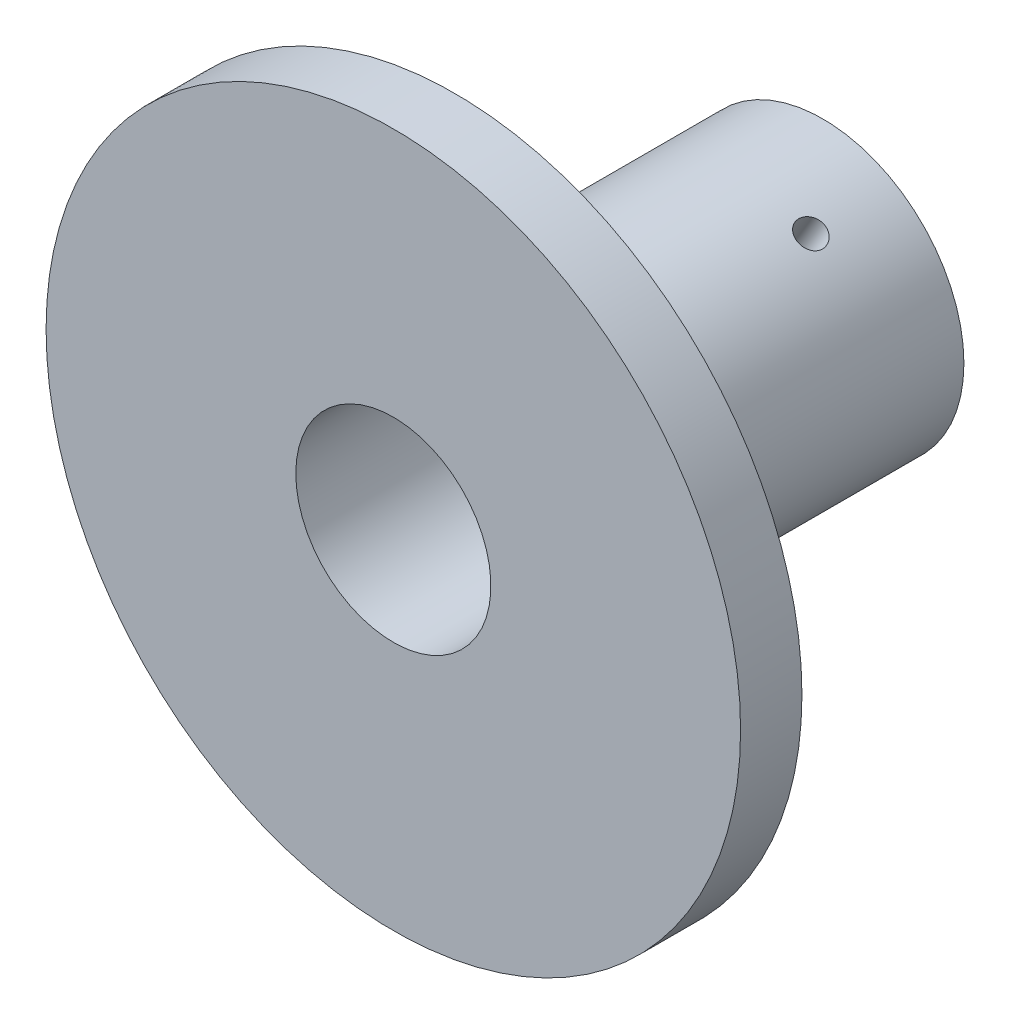
ISO-10303-21;
HEADER;
FILE_DESCRIPTION(('STEP AP214'),'2;1');
FILE_NAME('part.step','',(''),(''),'','','');
FILE_SCHEMA(('AUTOMOTIVE_DESIGN { 1 0 10303 214 1 1 1 1 }'));
ENDSEC;
DATA;
#1=APPLICATION_CONTEXT('core data for automotive mechanical design processes');
#2=APPLICATION_PROTOCOL_DEFINITION('international standard','automotive_design',2000,#1);
#3=PRODUCT_CONTEXT('',#1,'mechanical');
#4=PRODUCT('Part','Part','',(#3));
#5=PRODUCT_RELATED_PRODUCT_CATEGORY('part','',(#4));
#6=PRODUCT_DEFINITION_FORMATION('','',#4);
#7=PRODUCT_DEFINITION_CONTEXT('part definition',#1,'design');
#8=PRODUCT_DEFINITION('design','',#6,#7);
#9=PRODUCT_DEFINITION_SHAPE('','',#8);
#10=(LENGTH_UNIT() NAMED_UNIT(*) SI_UNIT(.MILLI.,.METRE.));
#11=(NAMED_UNIT(*) PLANE_ANGLE_UNIT() SI_UNIT($,.RADIAN.));
#12=(NAMED_UNIT(*) SI_UNIT($,.STERADIAN.) SOLID_ANGLE_UNIT());
#13=UNCERTAINTY_MEASURE_WITH_UNIT(LENGTH_MEASURE(1.E-05),#10,'distance_accuracy_value','');
#14=(GEOMETRIC_REPRESENTATION_CONTEXT(3) GLOBAL_UNCERTAINTY_ASSIGNED_CONTEXT((#13)) GLOBAL_UNIT_ASSIGNED_CONTEXT((#10,
#11,#12)) REPRESENTATION_CONTEXT('',''));
#15=CARTESIAN_POINT('',(0.,0.,0.));
#16=DIRECTION('',(0.,0.,1.));
#17=DIRECTION('',(1.,0.,0.));
#18=AXIS2_PLACEMENT_3D('',#15,#16,#17);
#19=CARTESIAN_POINT('',(0.,0.,0.));
#20=DIRECTION('',(0.,0.,1.));
#21=DIRECTION('',(1.,0.,0.));
#22=AXIS2_PLACEMENT_3D('',#19,#20,#21);
#23=PLANE('',#22);
#24=CARTESIAN_POINT('',(0.,0.,0.));
#25=DIRECTION('',(0.,0.,1.));
#26=DIRECTION('',(1.,0.,0.));
#27=AXIS2_PLACEMENT_3D('',#24,#25,#26);
#28=CIRCLE('',#27,28.3);
#29=CARTESIAN_POINT('',(28.3,0.,0.));
#30=VERTEX_POINT('',#29);
#31=EDGE_CURVE('E42',#30,#30,#28,.T.);
#32=ORIENTED_EDGE('',*,*,#31,.F.);
#33=EDGE_LOOP('',(#32));
#34=FACE_BOUND('',#33,.T.);
#35=CARTESIAN_POINT('',(0.,0.,0.));
#36=DIRECTION('',(0.,0.,1.));
#37=DIRECTION('',(1.,0.,0.));
#38=AXIS2_PLACEMENT_3D('',#35,#36,#37);
#39=CIRCLE('',#38,11.5);
#40=CARTESIAN_POINT('',(11.5,0.,0.));
#41=VERTEX_POINT('',#40);
#42=EDGE_CURVE('E10',#41,#41,#39,.F.);
#43=ORIENTED_EDGE('',*,*,#42,.F.);
#44=EDGE_LOOP('',(#43));
#45=FACE_BOUND('',#44,.T.);
#46=ADVANCED_FACE('F31',(#34,#45),#23,.F.);
#47=CARTESIAN_POINT('',(0.,0.,5.));
#48=DIRECTION('',(0.,0.,-1.));
#49=DIRECTION('',(-1.,0.,0.));
#50=AXIS2_PLACEMENT_3D('',#47,#48,#49);
#51=CYLINDRICAL_SURFACE('',#50,28.3);
#52=CARTESIAN_POINT('',(0.,0.,5.));
#53=DIRECTION('',(0.,0.,1.));
#54=DIRECTION('',(1.,0.,0.));
#55=AXIS2_PLACEMENT_3D('',#52,#53,#54);
#56=CIRCLE('',#55,28.3);
#57=CARTESIAN_POINT('',(28.3,0.,5.));
#58=VERTEX_POINT('',#57);
#59=EDGE_CURVE('E38',#58,#58,#56,.T.);
#60=ORIENTED_EDGE('',*,*,#59,.F.);
#61=EDGE_LOOP('',(#60));
#62=FACE_BOUND('',#61,.T.);
#63=ORIENTED_EDGE('',*,*,#31,.T.);
#64=EDGE_LOOP('',(#63));
#65=FACE_BOUND('',#64,.T.);
#66=ADVANCED_FACE('F33',(#62,#65),#51,.T.);
#67=CARTESIAN_POINT('',(0.,0.,5.));
#68=DIRECTION('',(0.,0.,1.));
#69=DIRECTION('',(1.,0.,0.));
#70=AXIS2_PLACEMENT_3D('',#67,#68,#69);
#71=PLANE('',#70);
#72=CARTESIAN_POINT('',(0.,0.,5.));
#73=DIRECTION('',(0.,0.,-1.));
#74=DIRECTION('',(-1.,0.,0.));
#75=AXIS2_PLACEMENT_3D('',#72,#73,#74);
#76=CIRCLE('',#75,7.95);
#77=CARTESIAN_POINT('',(-7.95,0.,5.));
#78=VERTEX_POINT('',#77);
#79=EDGE_CURVE('E51',#78,#78,#76,.T.);
#80=ORIENTED_EDGE('',*,*,#79,.T.);
#81=EDGE_LOOP('',(#80));
#82=FACE_BOUND('',#81,.T.);
#83=ORIENTED_EDGE('',*,*,#59,.T.);
#84=EDGE_LOOP('',(#83));
#85=FACE_BOUND('',#84,.T.);
#86=ADVANCED_FACE('F93',(#82,#85),#71,.T.);
#87=CARTESIAN_POINT('',(0.,0.,-30.));
#88=DIRECTION('',(0.,0.,1.));
#89=DIRECTION('',(1.,0.,0.));
#90=AXIS2_PLACEMENT_3D('',#87,#88,#89);
#91=CYLINDRICAL_SURFACE('',#90,11.5);
#92=CARTESIAN_POINT('',(4.95143261181863,10.3794660310933,-23.0908595693222));
#93=CARTESIAN_POINT('',(4.95143533973217,10.3794652363557,-23.1541842830061));
#94=CARTESIAN_POINT('',(4.95627734287464,10.377159188206,-23.217551004948));
#95=CARTESIAN_POINT('',(4.97549741899569,10.3679571071766,-23.342527982358));
#96=CARTESIAN_POINT('',(4.98988603402111,10.3610560000765,-23.4041362174475));
#97=CARTESIAN_POINT('',(5.02770916813772,10.3427549140707,-23.5237682432997));
#98=CARTESIAN_POINT('',(5.05113824269521,10.3313576428462,-23.5817941671249));
#99=CARTESIAN_POINT('',(5.1062640418036,10.3042227665628,-23.6926546462028));
#100=CARTESIAN_POINT('',(5.13795911038223,10.2884860308166,-23.745490238348));
#101=CARTESIAN_POINT('',(5.20870983172219,10.252848925534,-23.8446687849303));
#102=CARTESIAN_POINT('',(5.24778819150571,10.232935689967,-23.8909909198806));
#103=CARTESIAN_POINT('',(5.33200701723056,10.1893054540452,-23.9756484049697));
#104=CARTESIAN_POINT('',(5.37714775897332,10.1655882806247,-24.0139833915393));
#105=CARTESIAN_POINT('',(5.47218972180658,10.1147439706474,-24.0816500734095));
#106=CARTESIAN_POINT('',(5.52210039504762,10.0876100281358,-24.1109633852795));
#107=CARTESIAN_POINT('',(5.62507940784753,10.030550485264,-24.1596370139368));
#108=CARTESIAN_POINT('',(5.67814767282113,10.0006249508345,-24.1789975657137));
#109=CARTESIAN_POINT('',(5.78567310513844,9.9388036574385,-24.2071551544674));
#110=CARTESIAN_POINT('',(5.84012519573911,9.90691462063289,-24.2159863320771));
#111=CARTESIAN_POINT('',(5.94899047230267,9.84192716225639,-24.2229401141832));
#112=CARTESIAN_POINT('',(6.00340365920831,9.80882877107933,-24.2210629876199));
#113=CARTESIAN_POINT('',(6.1104576525164,9.74249763296856,-24.2066811836301));
#114=CARTESIAN_POINT('',(6.16310392918876,9.70926574434961,-24.1942132180504));
#115=CARTESIAN_POINT('',(6.26538482765031,9.64358074451773,-24.1590608359193));
#116=CARTESIAN_POINT('',(6.31501941145151,9.61112764313115,-24.1363762905315));
#117=CARTESIAN_POINT('',(6.41005548261484,9.54800774869863,-24.0813943533063));
#118=CARTESIAN_POINT('',(6.4554496344053,9.51734408438415,-24.0490806941487));
#119=CARTESIAN_POINT('',(6.54076250326032,9.45891661351875,-23.975769607742));
#120=CARTESIAN_POINT('',(6.58068106517889,9.43115288914038,-23.9347719345226));
#121=CARTESIAN_POINT('',(6.65422074198659,9.3794126055523,-23.8450500770351));
#122=CARTESIAN_POINT('',(6.68781452036845,9.35545255315485,-23.7962939609355));
#123=CARTESIAN_POINT('',(6.74768289440339,9.31236492027686,-23.692549999701));
#124=CARTESIAN_POINT('',(6.77395748002162,9.2932373464218,-23.6375621460224));
#125=CARTESIAN_POINT('',(6.81856331329248,9.26055952874416,-23.5228913069319));
#126=CARTESIAN_POINT('',(6.8368929713392,9.24701040107358,-23.4632073847593));
#127=CARTESIAN_POINT('',(6.86516144086473,9.22604307937327,-23.340850583697));
#128=CARTESIAN_POINT('',(6.87510049911514,9.21862470503525,-23.2781777927686));
#129=CARTESIAN_POINT('',(6.88632595295583,9.21024237889517,-23.1519025474002));
#130=CARTESIAN_POINT('',(6.88764831581119,9.20925159751754,-23.0883050693836));
#131=CARTESIAN_POINT('',(6.88170444119889,9.21369400465153,-22.9617397261807));
#132=CARTESIAN_POINT('',(6.87443831576919,9.2191271093627,-22.898771852792));
#133=CARTESIAN_POINT('',(6.85151474682409,9.23617599120735,-22.7753831031413));
#134=CARTESIAN_POINT('',(6.83587435027941,9.24777920790907,-22.7149573206803));
#135=CARTESIAN_POINT('',(6.79658352026356,9.27669358925424,-22.5982155719225));
#136=CARTESIAN_POINT('',(6.77293290935838,9.29400488033686,-22.5418996966978));
#137=CARTESIAN_POINT('',(6.7180899382593,9.3337245172297,-22.4347727157848));
#138=CARTESIAN_POINT('',(6.68687300578126,9.35614945571521,-22.3839803430253));
#139=CARTESIAN_POINT('',(6.61768447512105,9.40521377407129,-22.2895320704332));
#140=CARTESIAN_POINT('',(6.5797127153925,9.43185325473387,-22.2458763413263));
#141=CARTESIAN_POINT('',(6.49779563598999,9.48847378568168,-22.1667867488547));
#142=CARTESIAN_POINT('',(6.45383000162079,9.51846613458448,-22.1313820062015));
#143=CARTESIAN_POINT('',(6.36113742570787,9.58065975740242,-22.0699997222101));
#144=CARTESIAN_POINT('',(6.31241054748443,9.61286100193952,-22.0440220555219));
#145=CARTESIAN_POINT('',(6.21156111035442,9.67833216839077,-22.0022807502753));
#146=CARTESIAN_POINT('',(6.15944458682085,9.71160014014776,-21.9864994765625));
#147=CARTESIAN_POINT('',(6.05316046789141,9.77819918611305,-21.9655413661192));
#148=CARTESIAN_POINT('',(5.99899292808447,9.81153025858788,-21.9603642421926));
#149=CARTESIAN_POINT('',(5.89036695204297,9.87712438588287,-21.9607653507477));
#150=CARTESIAN_POINT('',(5.83591070322193,9.90939134910587,-21.9662983566803));
#151=CARTESIAN_POINT('',(5.72805304856155,9.97212625764667,-21.9878678844384));
#152=CARTESIAN_POINT('',(5.67465164362617,10.0025942014228,-22.0039044152645));
#153=CARTESIAN_POINT('',(5.57048625573955,10.0609766079697,-22.0460133563161));
#154=CARTESIAN_POINT('',(5.51972194043261,10.0888913928573,-22.0720844983672));
#155=CARTESIAN_POINT('',(5.42234725456127,10.1415589662866,-22.1335177438501));
#156=CARTESIAN_POINT('',(5.37573685513973,10.1663117767952,-22.1688797827315));
#157=CARTESIAN_POINT('',(5.28791350807113,10.2122691602432,-22.2480606687805));
#158=CARTESIAN_POINT('',(5.24672317773416,10.2334589612895,-22.2919131762384));
#159=CARTESIAN_POINT('',(5.17124638130273,10.2718064666387,-22.3867642918565));
#160=CARTESIAN_POINT('',(5.1369615759553,10.288963201173,-22.4377646140441));
#161=CARTESIAN_POINT('',(5.0763353970583,10.3190101335981,-22.5456006775366));
#162=CARTESIAN_POINT('',(5.05001383067446,10.3318897004212,-22.6024505058452));
#163=CARTESIAN_POINT('',(5.00632342110829,10.3531309932869,-22.7202333958352));
#164=CARTESIAN_POINT('',(4.98894445835472,10.3614978265192,-22.7811617535351));
#165=CARTESIAN_POINT('',(4.96805945430229,10.3715217798449,-22.8838405376762));
#166=CARTESIAN_POINT('',(4.9618340536444,10.3744987513465,-22.9249340650957));
#167=CARTESIAN_POINT('',(4.95351974419853,10.3784711341756,-23.007632203193));
#168=CARTESIAN_POINT('',(4.95143081878591,10.3794665534671,-23.0492368118161));
#169=CARTESIAN_POINT('',(4.95143261181863,10.3794660310933,-23.0908595693222));
#170=B_SPLINE_CURVE_WITH_KNOTS('',3,(#92,#93,#94,#95,#96,#97,#98,#99,#100,#101,#102,#103,#104,
#105,#106,#107,#108,#109,#110,#111,#112,#113,#114,#115,#116,#117,#118,#119,#120,#121,#122,#123,
#124,#125,#126,#127,#128,#129,#130,#131,#132,#133,#134,#135,#136,#137,#138,#139,#140,#141,#142,
#143,#144,#145,#146,#147,#148,#149,#150,#151,#152,#153,#154,#155,#156,#157,#158,#159,#160,#161,
#162,#163,#164,#165,#166,#167,#168,#169),.UNSPECIFIED.,.T.,.F.,(4,2,2,2,2,2,2,2,2,2,2,2,2,2,2,2,
2,2,2,2,2,2,2,2,2,2,2,2,2,2,2,2,2,2,2,2,2,2,4),(0.,0.189822145009531,0.37985425476398,
0.569772097598379,0.759651922329387,0.950125511715412,1.14060776942595,1.33147564073881,
1.5223390053625,1.712581813429,1.90281984354476,2.09240111525295,2.28198477774752,
2.47189055432326,2.66180171059994,2.8525157344691,3.04323001981221,3.23398244531104,
3.42472926049333,3.61467935954582,3.80462698070182,3.99418939950398,4.18375601757233,
4.37394671854997,4.56414196868191,4.75499865055358,4.9458527945473,5.1363759571469,
5.32689395966703,5.51660920093395,5.70632460477013,5.89601604023776,6.08570615782154,
6.2761642938456,6.4666681796279,6.65764208684942,6.84839940750905,6.97316827586514,
7.09793664276934),.UNSPECIFIED.);
#171=CARTESIAN_POINT('',(4.95143261181863,10.3794660310933,-23.0908595693222));
#172=VERTEX_POINT('',#171);
#173=EDGE_CURVE('E162',#172,#172,#170,.T.);
#174=ORIENTED_EDGE('',*,*,#173,.T.);
#175=EDGE_LOOP('',(#174));
#176=FACE_BOUND('',#175,.T.);
#177=CARTESIAN_POINT('',(6.51316495473505,-9.47779944250833,-23.0908595693222));
#178=CARTESIAN_POINT('',(6.51316290251533,-9.47780140758195,-23.1541842830061));
#179=CARTESIAN_POINT('',(6.50874480466411,-9.48084168123369,-23.217551004948));
#180=CARTESIAN_POINT('',(6.49116553066446,-9.49288571490251,-23.342527982358));
#181=CARTESIAN_POINT('',(6.47799468908883,-9.50189606748974,-23.4041362174475));
#182=CARTESIAN_POINT('',(6.44323391663263,-9.52550131948255,-23.5237682432997));
#183=CARTESIAN_POINT('',(6.42164905293972,-9.54009285762429,-23.5817941671249));
#184=CARTESIAN_POINT('',(6.37058666119555,-9.57426576191438,-23.6926546462028));
#185=CARTESIAN_POINT('',(6.34111071397736,-9.59384612860504,-23.745490238348));
#186=CARTESIAN_POINT('',(6.27487271481531,-9.63729949798022,-23.8446687849303));
#187=CARTESIAN_POINT('',(6.23808816705101,-9.66118573250749,-23.8909909198806));
#188=CARTESIAN_POINT('',(6.15819386150713,-9.71230625710117,-23.9756484049697));
#189=CARTESIAN_POINT('',(6.11508381594769,-9.73954069948585,-24.0139833915393));
#190=CARTESIAN_POINT('',(6.0235303704528,-9.79642729873632,-24.0816500734095));
#191=CARTESIAN_POINT('',(5.97507635031239,-9.82608423842724,-24.1109633852795));
#192=CARTESIAN_POINT('',(5.87417183025718,-9.88673690813273,-24.1596370139368));
#193=CARTESIAN_POINT('',(5.82172142473254,-9.91773260651985,-24.1789975657137));
#194=CARTESIAN_POINT('',(5.71441989799817,-9.97994171576157,-24.2071551544674));
#195=CARTESIAN_POINT('',(5.65957713672196,-10.0111540911081,-24.2159863320771));
#196=CARTESIAN_POINT('',(5.54886370855875,-10.0729404570139,-24.2229401141832));
#197=CARTESIAN_POINT('',(5.4929930675222,-10.1035144635865,-24.2210629876199));
#198=CARTESIAN_POINT('',(5.38202162020229,-10.1630603723125,-24.2066811836301));
#199=CARTESIAN_POINT('',(5.32691882210637,-10.192037441016,-24.1942132180504));
#200=CARTESIAN_POINT('',(5.21889349437361,-10.2477727974896,-24.1590608359193));
#201=CARTESIAN_POINT('',(5.16597099224063,-10.2745310572745,-24.1363762905315));
#202=CARTESIAN_POINT('',(5.06378952459621,-10.3252747619615,-24.0813943533063));
#203=CARTESIAN_POINT('',(5.01453693643152,-10.349255418438,-24.0490806941487));
#204=CARTESIAN_POINT('',(4.92128082795571,-10.3939247947035,-23.975769607742));
#205=CARTESIAN_POINT('',(4.87727745638108,-10.4146134212184,-23.9347719345226));
#206=CARTESIAN_POINT('',(4.79569921799094,-10.4524305077259,-23.8450500770351));
#207=CARTESIAN_POINT('',(4.75815231474782,-10.469543547015,-23.7962939609355));
#208=CARTESIAN_POINT('',(4.69090314306906,-10.4998472633735,-23.692549999701));
#209=CARTESIAN_POINT('',(4.6612008853887,-10.5130379350653,-23.6375621460224));
#210=CARTESIAN_POINT('',(4.6105981485042,-10.535328810996,-23.5228913069319));
#211=CARTESIAN_POINT('',(4.589699430719,-10.5444281966718,-23.4632073847593));
#212=CARTESIAN_POINT('',(4.55740696271444,-10.5584257485569,-23.340850583697));
#213=CARTESIAN_POINT('',(4.54601293295773,-10.5633240383224,-23.2781777927686));
#214=CARTESIAN_POINT('',(4.53314089865727,-10.5688544034474,-23.1519025474002));
#215=CARTESIAN_POINT('',(4.53162167538697,-10.5695042125844,-23.0883050693836));
#216=CARTESIAN_POINT('',(4.5384408501251,-10.5665778697402,-22.9617397261807));
#217=CARTESIAN_POINT('',(4.54677911954125,-10.5630017728866,-22.898771852792));
#218=CARTESIAN_POINT('',(4.57300566879739,-10.5516738207571,-22.7753831031413));
#219=CARTESIAN_POINT('',(4.59087454749903,-10.543930448375,-22.7149573206803));
#220=CARTESIAN_POINT('',(4.63556055128659,-10.5243607821181,-22.5982155719225));
#221=CARTESIAN_POINT('',(4.66237787458903,-10.5125343978005,-22.5418996966978));
#222=CARTESIAN_POINT('',(4.72419757471687,-10.4848988100561,-22.4347727157848));
#223=CARTESIAN_POINT('',(4.75922660736264,-10.4690766227446,-22.3839803430253));
#224=CARTESIAN_POINT('',(4.83631181880847,-10.4336897567204,-22.2895320704332));
#225=CARTESIAN_POINT('',(4.87836816567017,-10.4141249885004,-22.2458763413263));
#226=CARTESIAN_POINT('',(4.96836152354799,-10.3714929822079,-22.1667867488547));
#227=CARTESIAN_POINT('',(5.01631847680159,-10.348413800402,-22.1313820062015));
#228=CARTESIAN_POINT('',(5.11652602207177,-10.2992364863282,-22.0699997222101));
#229=CARTESIAN_POINT('',(5.16877655698609,-10.2731383942081,-22.0440220555219));
#230=CARTESIAN_POINT('',(5.27590096891328,-10.2185358029218,-22.0022807502753));
#231=CARTESIAN_POINT('',(5.33077013935401,-10.1900355554633,-21.9864994765625));
#232=CARTESIAN_POINT('',(5.44158866449247,-10.1312903314342,-21.9655413661192));
#233=CARTESIAN_POINT('',(5.49753798989452,-10.1010454021383,-21.9603642421926));
#234=CARTESIAN_POINT('',(5.60865715849181,-10.039769611023,-21.9607653507477));
#235=CARTESIAN_POINT('',(5.66382929275642,-10.0087425977607,-21.9662983566803));
#236=CARTESIAN_POINT('',(5.77208814458703,-9.94670258310256,-21.9878678844384));
#237=CARTESIAN_POINT('',(5.82517486036596,-9.91568958171883,-22.0039044152645));
#238=CARTESIAN_POINT('',(5.92781820151297,-9.85467091288741,-22.0460133563161));
#239=CARTESIAN_POINT('',(5.9773752720202,-9.82466511866964,-22.0720844983672));
#240=CARTESIAN_POINT('',(6.0716740715014,-9.76666995373422,-22.13351774385));
#241=CARTESIAN_POINT('',(6.11641583392763,-9.73868056900889,-22.1688797827315));
#242=CARTESIAN_POINT('',(6.20012776901941,-9.68560201112614,-22.2480606687805));
#243=CARTESIAN_POINT('',(6.23907384019508,-9.66052503918717,-22.2919131762384));
#244=CARTESIAN_POINT('',(6.31002215221496,-9.61433396875589,-22.3867642918565));
#245=CARTESIAN_POINT('',(6.34202272284142,-9.59322082362839,-22.4377646140441));
#246=CARTESIAN_POINT('',(6.39835721907585,-9.55574047878175,-22.5456006775366));
#247=CARTESIAN_POINT('',(6.42267203432624,-9.53938511703746,-22.6024505058452));
#248=CARTESIAN_POINT('',(6.46291273834028,-9.51216875888428,-22.7202333958352));
#249=CARTESIAN_POINT('',(6.47884810984543,-9.50130155226439,-22.7811617535351));
#250=CARTESIAN_POINT('',(6.49797161009806,-9.4882265848597,-22.8838405376762));
#251=CARTESIAN_POINT('',(6.50366244337377,-9.48432371549205,-22.9249340650957));
#252=CARTESIAN_POINT('',(6.51125978254028,-9.47910950371157,-23.007632203193));
#253=CARTESIAN_POINT('',(6.51316630364038,-9.47779815088333,-23.0492368118161));
#254=CARTESIAN_POINT('',(6.51316495473505,-9.47779944250833,-23.0908595693222));
#255=B_SPLINE_CURVE_WITH_KNOTS('',3,(#177,#178,#179,#180,#181,#182,#183,#184,#185,#186,#187,
#188,#189,#190,#191,#192,#193,#194,#195,#196,#197,#198,#199,#200,#201,#202,#203,#204,#205,#206,
#207,#208,#209,#210,#211,#212,#213,#214,#215,#216,#217,#218,#219,#220,#221,#222,#223,#224,#225,
#226,#227,#228,#229,#230,#231,#232,#233,#234,#235,#236,#237,#238,#239,#240,#241,#242,#243,#244,
#245,#246,#247,#248,#249,#250,#251,#252,#253,#254),.UNSPECIFIED.,.T.,.F.,(4,2,2,2,2,2,2,2,2,2,2,
2,2,2,2,2,2,2,2,2,2,2,2,2,2,2,2,2,2,2,2,2,2,2,2,2,2,2,4),(0.,0.189822145009531,0.37985425476398,
0.569772097598378,0.759651922329387,0.950125511715412,1.14060776942594,1.33147564073881,
1.5223390053625,1.712581813429,1.90281984354476,2.09240111525294,2.28198477774752,
2.47189055432326,2.66180171059994,2.85251573446911,3.04323001981221,3.23398244531104,
3.42472926049333,3.61467935954583,3.80462698070182,3.99418939950399,4.18375601757233,
4.37394671854997,4.56414196868191,4.75499865055359,4.94585279454731,5.13637595714691,
5.32689395966703,5.51660920093396,5.70632460477013,5.89601604023776,6.08570615782154,
6.2761642938456,6.46666817962791,6.65764208684943,6.84839940750905,6.97316827586515,
7.09793664276935),.UNSPECIFIED.);
#256=CARTESIAN_POINT('',(6.51316495473505,-9.47779944250833,-23.0908595693222));
#257=VERTEX_POINT('',#256);
#258=EDGE_CURVE('E171',#257,#257,#255,.T.);
#259=ORIENTED_EDGE('',*,*,#258,.T.);
#260=EDGE_LOOP('',(#259));
#261=FACE_BOUND('',#260,.T.);
#262=CARTESIAN_POINT('',(-11.4645975665537,-0.901666588584858,-23.0908595693222));
#263=CARTESIAN_POINT('',(-11.4645982422476,-0.901663828773629,-23.1541842830061));
#264=CARTESIAN_POINT('',(-11.4650221475388,-0.896317506972204,-23.217551004948));
#265=CARTESIAN_POINT('',(-11.4666629496602,-0.875071392274016,-23.342527982358));
#266=CARTESIAN_POINT('',(-11.46788072311,-0.859159932586683,-23.4041362174475));
#267=CARTESIAN_POINT('',(-11.4709430847704,-0.817253594588034,-23.5237682432997));
#268=CARTESIAN_POINT('',(-11.472787295635,-0.791264785221871,-23.5817941671249));
#269=CARTESIAN_POINT('',(-11.4768507029992,-0.729957004648393,-23.6926546462028));
#270=CARTESIAN_POINT('',(-11.4790698243596,-0.694639902211495,-23.745490238348));
#271=CARTESIAN_POINT('',(-11.4835825465375,-0.615549427553719,-23.8446687849303));
#272=CARTESIAN_POINT('',(-11.4858763585568,-0.571749957459476,-23.8909909198806));
#273=CARTESIAN_POINT('',(-11.4902008787377,-0.476999196943921,-23.9756484049697));
#274=CARTESIAN_POINT('',(-11.4922315749211,-0.426047581138805,-24.0139833915393));
#275=CARTESIAN_POINT('',(-11.4957200922594,-0.318316671910997,-24.0816500734095));
#276=CARTESIAN_POINT('',(-11.49717674536,-0.261525789708461,-24.1109633852795));
#277=CARTESIAN_POINT('',(-11.4992512381048,-0.143813577131228,-24.1596370139368));
#278=CARTESIAN_POINT('',(-11.4998690975537,-0.0828923443145395,-24.1789975657137));
#279=CARTESIAN_POINT('',(-11.5000930031367,0.0411380583231412,-24.2071551544674));
#280=CARTESIAN_POINT('',(-11.4997023324611,0.104239470475297,-24.2159863320771));
#281=CARTESIAN_POINT('',(-11.4978541808615,0.23101329475761,-24.2229401141832));
#282=CARTESIAN_POINT('',(-11.4963967267306,0.294685692507292,-24.2210629876199));
#283=CARTESIAN_POINT('',(-11.4924792727187,0.420562739344054,-24.2066811836301));
#284=CARTESIAN_POINT('',(-11.4900227512952,0.482771696666452,-24.1942132180504));
#285=CARTESIAN_POINT('',(-11.484278322024,0.604192052971991,-24.1590608359193));
#286=CARTESIAN_POINT('',(-11.4809904036922,0.663403414143395,-24.1363762905315));
#287=CARTESIAN_POINT('',(-11.4738450072111,0.777267013262966,-24.0813943533063));
#288=CARTESIAN_POINT('',(-11.4699865708369,0.831911334053987,-24.0490806941487));
#289=CARTESIAN_POINT('',(-11.4620433312161,0.935008181184861,-23.975769607742));
#290=CARTESIAN_POINT('',(-11.45795852156,0.983460532078076,-23.9347719345226));
#291=CARTESIAN_POINT('',(-11.4499199599776,1.07301790217368,-23.8450500770351));
#292=CARTESIAN_POINT('',(-11.4459668351163,1.1140909938602,-23.7962939609355));
#293=CARTESIAN_POINT('',(-11.4385860374725,1.18748234309672,-23.692549999701));
#294=CARTESIAN_POINT('',(-11.4351583654104,1.21980058864355,-23.6375621460224));
#295=CARTESIAN_POINT('',(-11.4291614617967,1.27476928225191,-23.5228913069319));
#296=CARTESIAN_POINT('',(-11.4265924020582,1.29741779559834,-23.4632073847593));
#297=CARTESIAN_POINT('',(-11.4225684035792,1.33238266918371,-23.340850583697));
#298=CARTESIAN_POINT('',(-11.4211134320729,1.34469933328727,-23.2781777927686));
#299=CARTESIAN_POINT('',(-11.4194668516131,1.35861202455236,-23.1519025474002));
#300=CARTESIAN_POINT('',(-11.4192699911982,1.36025261506693,-23.0883050693836));
#301=CARTESIAN_POINT('',(-11.420145291324,1.35288386508878,-22.9617397261807));
#302=CARTESIAN_POINT('',(-11.4212174353105,1.34387466352399,-22.898771852792));
#303=CARTESIAN_POINT('',(-11.4245204156215,1.3154978295498,-22.7753831031413));
#304=CARTESIAN_POINT('',(-11.4267488977785,1.29615124046598,-22.7149573206803));
#305=CARTESIAN_POINT('',(-11.4321440715502,1.2476671928639,-22.5982155719225));
#306=CARTESIAN_POINT('',(-11.4353107839475,1.21852951746368,-22.5418996966978));
#307=CARTESIAN_POINT('',(-11.4422875129762,1.15117429282644,-22.4347727157848));
#308=CARTESIAN_POINT('',(-11.4460996131439,1.11292716702948,-22.3839803430253));
#309=CARTESIAN_POINT('',(-11.4539962939296,1.02847598264918,-22.2895320704332));
#310=CARTESIAN_POINT('',(-11.4580808810627,0.982271733766567,-22.2458763413263));
#311=CARTESIAN_POINT('',(-11.466157159538,0.883019196526259,-22.1667867488547));
#312=CARTESIAN_POINT('',(-11.4701484784224,0.829947665817633,-22.1313820062015));
#313=CARTESIAN_POINT('',(-11.4776634477797,0.718576728925854,-22.0699997222101));
#314=CARTESIAN_POINT('',(-11.4811871044706,0.660277392268698,-22.0440220555219));
#315=CARTESIAN_POINT('',(-11.4874620792677,0.540203634531127,-22.0022807502753));
#316=CARTESIAN_POINT('',(-11.4902147261749,0.478435415315624,-21.9864994765625));
#317=CARTESIAN_POINT('',(-11.4947491323839,0.353091145321244,-21.9655413661192));
#318=CARTESIAN_POINT('',(-11.496530917979,0.289515143550512,-21.9603642421926));
#319=CARTESIAN_POINT('',(-11.4990241105348,0.162645225140197,-21.9607653507477));
#320=CARTESIAN_POINT('',(-11.4997399959784,0.099351248654866,-21.9662983566803));
#321=CARTESIAN_POINT('',(-11.5001411931486,-0.0254236745440231,-21.9878678844384));
#322=CARTESIAN_POINT('',(-11.4998265039922,-0.0869046197039275,-22.0039044152645));
#323=CARTESIAN_POINT('',(-11.4983044572526,-0.206305695082257,-22.0460133563161));
#324=CARTESIAN_POINT('',(-11.4970972124529,-0.264226274187546,-22.0720844983672));
#325=CARTESIAN_POINT('',(-11.4940213260627,-0.37488901255235,-22.1335177438501));
#326=CARTESIAN_POINT('',(-11.4921526890674,-0.427631207786212,-22.1688797827315));
#327=CARTESIAN_POINT('',(-11.4880412770906,-0.526667149117022,-22.2480606687805));
#328=CARTESIAN_POINT('',(-11.4857970179293,-0.572933922102238,-22.2919131762384));
#329=CARTESIAN_POINT('',(-11.4812685335177,-0.657472497882715,-22.3867642918565));
#330=CARTESIAN_POINT('',(-11.4789842987968,-0.69574237754458,-22.4377646140441));
#331=CARTESIAN_POINT('',(-11.4746926161342,-0.763269654816312,-22.5456006775366));
#332=CARTESIAN_POINT('',(-11.4726858650008,-0.792504583383618,-22.6024505058452));
#333=CARTESIAN_POINT('',(-11.4692361594486,-0.840962234402538,-22.7202333958352));
#334=CARTESIAN_POINT('',(-11.4677925682002,-0.860196274254682,-22.7811617535351));
#335=CARTESIAN_POINT('',(-11.4660310644004,-0.883295194985083,-22.8838405376762));
#336=CARTESIAN_POINT('',(-11.4654964970182,-0.890175035854377,-22.9249340650957));
#337=CARTESIAN_POINT('',(-11.4647795267389,-0.899361630463986,-23.007632203193));
#338=CARTESIAN_POINT('',(-11.4645971224263,-0.901668402583641,-23.0492368118161));
#339=CARTESIAN_POINT('',(-11.4645975665537,-0.901666588584858,-23.0908595693222));
#340=B_SPLINE_CURVE_WITH_KNOTS('',3,(#262,#263,#264,#265,#266,#267,#268,#269,#270,#271,#272,
#273,#274,#275,#276,#277,#278,#279,#280,#281,#282,#283,#284,#285,#286,#287,#288,#289,#290,#291,
#292,#293,#294,#295,#296,#297,#298,#299,#300,#301,#302,#303,#304,#305,#306,#307,#308,#309,#310,
#311,#312,#313,#314,#315,#316,#317,#318,#319,#320,#321,#322,#323,#324,#325,#326,#327,#328,#329,
#330,#331,#332,#333,#334,#335,#336,#337,#338,#339),.UNSPECIFIED.,.T.,.F.,(4,2,2,2,2,2,2,2,2,2,2,
2,2,2,2,2,2,2,2,2,2,2,2,2,2,2,2,2,2,2,2,2,2,2,2,2,2,2,4),(0.,0.189822145009531,0.37985425476398,
0.569772097598382,0.759651922329387,0.950125511715412,1.14060776942595,1.33147564073881,
1.5223390053625,1.712581813429,1.90281984354476,2.09240111525294,2.28198477774752,
2.47189055432326,2.66180171059994,2.8525157344691,3.04323001981221,3.23398244531104,
3.42472926049333,3.61467935954582,3.80462698070182,3.99418939950398,4.18375601757233,
4.37394671854997,4.56414196868191,4.75499865055358,4.9458527945473,5.1363759571469,
5.32689395966702,5.51660920093395,5.70632460477012,5.89601604023775,6.08570615782154,
6.2761642938456,6.4666681796279,6.65764208684942,6.84839940750904,6.97316827586514,
7.09793664276934),.UNSPECIFIED.);
#341=CARTESIAN_POINT('',(-11.4645975665537,-0.901666588584858,-23.0908595693222));
#342=VERTEX_POINT('',#341);
#343=EDGE_CURVE('E55',#342,#342,#340,.T.);
#344=ORIENTED_EDGE('',*,*,#343,.T.);
#345=EDGE_LOOP('',(#344));
#346=FACE_BOUND('',#345,.T.);
#347=CARTESIAN_POINT('',(0.,0.,-30.));
#348=DIRECTION('',(0.,0.,-1.));
#349=DIRECTION('',(-1.,0.,0.));
#350=AXIS2_PLACEMENT_3D('',#347,#348,#349);
#351=CIRCLE('',#350,11.5);
#352=CARTESIAN_POINT('',(-11.5,0.,-30.));
#353=VERTEX_POINT('',#352);
#354=EDGE_CURVE('E47',#353,#353,#351,.T.);
#355=ORIENTED_EDGE('',*,*,#354,.F.);
#356=EDGE_LOOP('',(#355));
#357=FACE_BOUND('',#356,.T.);
#358=ORIENTED_EDGE('',*,*,#42,.T.);
#359=EDGE_LOOP('',(#358));
#360=FACE_BOUND('',#359,.T.);
#361=ADVANCED_FACE('F69',(#176,#261,#346,#357,#360),#91,.T.);
#362=CARTESIAN_POINT('',(0.,0.,-30.));
#363=DIRECTION('',(0.,0.,-1.));
#364=DIRECTION('',(-1.,0.,0.));
#365=AXIS2_PLACEMENT_3D('',#362,#363,#364);
#366=PLANE('',#365);
#367=CARTESIAN_POINT('',(0.,0.,-30.));
#368=DIRECTION('',(0.,0.,-1.));
#369=DIRECTION('',(-1.,0.,0.));
#370=AXIS2_PLACEMENT_3D('',#367,#368,#369);
#371=CIRCLE('',#370,7.95);
#372=CARTESIAN_POINT('',(-7.95,0.,-30.));
#373=VERTEX_POINT('',#372);
#374=EDGE_CURVE('E52',#373,#373,#371,.T.);
#375=ORIENTED_EDGE('',*,*,#374,.F.);
#376=EDGE_LOOP('',(#375));
#377=FACE_BOUND('',#376,.T.);
#378=ORIENTED_EDGE('',*,*,#354,.T.);
#379=EDGE_LOOP('',(#378));
#380=FACE_BOUND('',#379,.T.);
#381=ADVANCED_FACE('F86',(#377,#380),#366,.T.);
#382=CARTESIAN_POINT('',(0.,0.,5.));
#383=DIRECTION('',(0.,0.,-1.));
#384=DIRECTION('',(-1.,0.,0.));
#385=AXIS2_PLACEMENT_3D('',#382,#383,#384);
#386=CYLINDRICAL_SURFACE('',#385,7.95);
#387=CARTESIAN_POINT('',(3.10245613542375,7.31964930360543,-23.0908595693222));
#388=CARTESIAN_POINT('',(3.1024589141136,7.31964880645311,-23.0277153293726));
#389=CARTESIAN_POINT('',(3.10739747343123,7.31756097664136,-22.9645334988014));
#390=CARTESIAN_POINT('',(3.12698441528935,7.30921182178219,-22.8399336259938));
#391=CARTESIAN_POINT('',(3.141642492995,7.30294632950511,-22.7785174088336));
#392=CARTESIAN_POINT('',(3.18012556363629,7.28627053234785,-22.6592704992015));
#393=CARTESIAN_POINT('',(3.20394379203623,7.27586328584976,-22.6014371973453));
#394=CARTESIAN_POINT('',(3.25990737241095,7.25096114778696,-22.490924378764));
#395=CARTESIAN_POINT('',(3.29205148636533,7.23646686391729,-22.4382440974118));
#396=CARTESIAN_POINT('',(3.36381876105557,7.20338740322353,-22.3391441672663));
#397=CARTESIAN_POINT('',(3.40348875674222,7.18477648050917,-22.2927670247554));
#398=CARTESIAN_POINT('',(3.48887296481815,7.14370389605135,-22.2079578193185));
#399=CARTESIAN_POINT('',(3.53458749855596,7.12124202955957,-22.1695261790814));
#400=CARTESIAN_POINT('',(3.63081401166176,7.07266586123144,-22.1015434001901));
#401=CARTESIAN_POINT('',(3.68134579465417,7.04653625363633,-22.0720311998517));
#402=CARTESIAN_POINT('',(3.78544987257076,6.9911616511181,-22.0229747602318));
#403=CARTESIAN_POINT('',(3.83902202265853,6.96191680454001,-22.0034300465632));
#404=CARTESIAN_POINT('',(3.94718749764025,6.90116155155823,-21.9749916746624));
#405=CARTESIAN_POINT('',(4.00177148278071,6.86966777921384,-21.9660269769311));
#406=CARTESIAN_POINT('',(4.11068450304389,6.80505554077316,-21.9587826685622));
#407=CARTESIAN_POINT('',(4.16501355082893,6.77193715632484,-21.9605025214971));
#408=CARTESIAN_POINT('',(4.27147472779417,6.70529051501639,-21.9745221444931));
#409=CARTESIAN_POINT('',(4.32361987884039,6.67176693894101,-21.9867454964514));
#410=CARTESIAN_POINT('',(4.42473140141609,6.60514346513351,-22.0213053536852));
#411=CARTESIAN_POINT('',(4.47369769797208,6.57204357740888,-22.0436420973868));
#412=CARTESIAN_POINT('',(4.56738192698457,6.50728665306247,-22.0978739141192));
#413=CARTESIAN_POINT('',(4.61208473773923,6.47563494526773,-22.1298014555292));
#414=CARTESIAN_POINT('',(4.69599737811309,6.41504414182736,-22.2022848874788));
#415=CARTESIAN_POINT('',(4.73520688220623,6.38610520697065,-22.2428412889948));
#416=CARTESIAN_POINT('',(4.80757413291846,6.33180856586863,-22.3318576769465));
#417=CARTESIAN_POINT('',(4.84067533306908,6.30648476996117,-22.3803843456608));
#418=CARTESIAN_POINT('',(4.89966509512149,6.26076506228861,-22.4837363916807));
#419=CARTESIAN_POINT('',(4.92555362072529,6.24036917532342,-22.538561800683));
#420=CARTESIAN_POINT('',(4.96956781909318,6.20537594888655,-22.6530204372168));
#421=CARTESIAN_POINT('',(4.9876884374069,6.1907823853383,-22.7126567652438));
#422=CARTESIAN_POINT('',(5.01574058253076,6.16807710291304,-22.835009348171));
#423=CARTESIAN_POINT('',(5.02567262518218,6.15996497573739,-22.897725408799));
#424=CARTESIAN_POINT('',(5.037076451337,6.15064349874373,-23.023871978933));
#425=CARTESIAN_POINT('',(5.03862120257101,6.14937461475291,-23.0872915006352));
#426=CARTESIAN_POINT('',(5.03341242795356,6.1536387785056,-23.2135569065156));
#427=CARTESIAN_POINT('',(5.02665913260106,6.15917163731373,-23.2764028065787));
#428=CARTESIAN_POINT('',(5.00505305102346,6.17674140921288,-23.3994512861346));
#429=CARTESIAN_POINT('',(4.99023646585458,6.18874924994891,-23.4596643901777));
#430=CARTESIAN_POINT('',(4.95284864683033,6.21871054029996,-23.5760690687661));
#431=CARTESIAN_POINT('',(4.93027706610506,6.23666425586419,-23.6322604632902));
#432=CARTESIAN_POINT('',(4.87768199447349,6.27788483950134,-23.7394459207888));
#433=CARTESIAN_POINT('',(4.84760896649981,6.30118694141134,-23.7904021205451));
#434=CARTESIAN_POINT('',(4.78073864204829,6.35207043883827,-23.88528246501));
#435=CARTESIAN_POINT('',(4.74394100507928,6.37965205103154,-23.9292062534309));
#436=CARTESIAN_POINT('',(4.66413729569261,6.43822853629098,-24.009107369173));
#437=CARTESIAN_POINT('',(4.62108702500065,6.46924730082622,-24.0450230760309));
#438=CARTESIAN_POINT('',(4.53000054899645,6.53335229366042,-24.1074601798844));
#439=CARTESIAN_POINT('',(4.48196446861714,6.56643847014653,-24.1339818122005));
#440=CARTESIAN_POINT('',(4.38228117380212,6.63337778815195,-24.1767783563403));
#441=CARTESIAN_POINT('',(4.33064671183928,6.66722795982893,-24.1930875941138));
#442=CARTESIAN_POINT('',(4.22500413128791,6.73466887050892,-24.21510768545));
#443=CARTESIAN_POINT('',(4.17099615306888,6.76825962471608,-24.220819164902));
#444=CARTESIAN_POINT('',(4.06261626858018,6.83385884234857,-24.2214675247305));
#445=CARTESIAN_POINT('',(4.00825176549564,6.86587864240357,-24.2164989273174));
#446=CARTESIAN_POINT('',(3.90027132386886,6.92778883746379,-24.1961299773657));
#447=CARTESIAN_POINT('',(3.84665538361533,6.95767923733763,-24.1807296486788));
#448=CARTESIAN_POINT('',(3.74180507774399,7.01462436027573,-24.1399666845919));
#449=CARTESIAN_POINT('',(3.69056932528825,7.04168074643456,-24.1146099339178));
#450=CARTESIAN_POINT('',(3.59200144094211,7.09246807960455,-24.0546638565517));
#451=CARTESIAN_POINT('',(3.54466940965725,7.11619894092231,-24.0200742920117));
#452=CARTESIAN_POINT('',(3.4549972279798,7.16016849646313,-23.9422999184662));
#453=CARTESIAN_POINT('',(3.41270252308073,7.18037606509031,-23.8990451092505));
#454=CARTESIAN_POINT('',(3.33493083662999,7.21682658144913,-23.8053151341511));
#455=CARTESIAN_POINT('',(3.29945546116898,7.23306859545478,-23.7548382721982));
#456=CARTESIAN_POINT('',(3.23636469032399,7.26151849820703,-23.6478011310126));
#457=CARTESIAN_POINT('',(3.20878962441444,7.2737057373837,-23.5912115997367));
#458=CARTESIAN_POINT('',(3.16273512796451,7.29384973189177,-23.4737872303723));
#459=CARTESIAN_POINT('',(3.1442461072144,7.30181094845331,-23.4129569461455));
#460=CARTESIAN_POINT('',(3.12128778746582,7.31164556310685,-23.3083424452439));
#461=CARTESIAN_POINT('',(3.11423857378189,7.31464589280295,-23.2652092487923));
#462=CARTESIAN_POINT('',(3.10482181089755,7.31864792428037,-23.178343235654));
#463=CARTESIAN_POINT('',(3.10245421014822,7.3196496480682,-23.1346104255751));
#464=CARTESIAN_POINT('',(3.10245613542375,7.31964930360543,-23.0908595693222));
#465=B_SPLINE_CURVE_WITH_KNOTS('',3,(#387,#388,#389,#390,#391,#392,#393,#394,#395,#396,#397,
#398,#399,#400,#401,#402,#403,#404,#405,#406,#407,#408,#409,#410,#411,#412,#413,#414,#415,#416,
#417,#418,#419,#420,#421,#422,#423,#424,#425,#426,#427,#428,#429,#430,#431,#432,#433,#434,#435,
#436,#437,#438,#439,#440,#441,#442,#443,#444,#445,#446,#447,#448,#449,#450,#451,#452,#453,#454,
#455,#456,#457,#458,#459,#460,#461,#462,#463,#464),.UNSPECIFIED.,.T.,.F.,(4,2,2,2,2,2,2,2,2,2,2,
2,2,2,2,2,2,2,2,2,2,2,2,2,2,2,2,2,2,2,2,2,2,2,2,2,2,2,4),(0.,0.189272835091562,
0.378734753363583,0.568057026709497,0.757351164860088,0.94786443821955,1.13838784399845,
1.32973136000603,1.52106576846784,1.71110801794376,1.90114072625049,2.08980244763104,
2.27846861699509,2.46778083008507,2.65710425682494,2.84810087831282,3.03909846097935,
3.2302201347036,3.42132976775229,3.61077408967455,3.80021314942671,3.98880863447186,
4.17741255622262,4.36729655063405,4.55719016222128,4.7484980716197,4.93980118843902,
5.13045779519547,5.32110314167353,5.51006816508286,5.69903275643186,5.88788582830094,
6.07674376571447,6.26719378504943,6.45768860442465,6.64913920653735,6.84038729852643,
6.97153053168033,7.10267232081702),.UNSPECIFIED.);
#466=CARTESIAN_POINT('',(3.10245613542375,7.31964930360543,-23.0908595693222));
#467=VERTEX_POINT('',#466);
#468=EDGE_CURVE('E158',#467,#467,#465,.T.);
#469=ORIENTED_EDGE('',*,*,#468,.T.);
#470=EDGE_LOOP('',(#469));
#471=FACE_BOUND('',#470,.T.);
#472=CARTESIAN_POINT('',(4.78777417600348,-6.3466304792066,-23.0908595693222));
#473=CARTESIAN_POINT('',(4.78777235611201,-6.34663263704644,-23.0277153293726));
#474=CARTESIAN_POINT('',(4.78349496279744,-6.34986563996772,-22.9645334988014));
#475=CARTESIAN_POINT('',(4.76647091166021,-6.36265385176972,-22.8399336259938));
#476=CARTESIAN_POINT('',(4.75371579732822,-6.37221537329492,-22.7785174088336));
#477=CARTESIAN_POINT('',(4.72003259804104,-6.39720479150728,-22.6592704992015));
#478=CARTESIAN_POINT('',(4.69911054399027,-6.41262835912573,-22.6014371973453));
#479=CARTESIAN_POINT('',(4.64956286963197,-6.44864317238556,-22.490924378764));
#480=CARTESIAN_POINT('',(4.62093839461399,-6.46923364971736,-22.4382440974118));
#481=CARTESIAN_POINT('',(4.55640710396459,-6.5148462024126,-22.3391441672663));
#482=CARTESIAN_POINT('',(4.52045457426275,-6.53989596508808,-22.2927670247554));
#483=CARTESIAN_POINT('',(4.44219256868523,-6.59330456613494,-22.2079578193185));
#484=CARTESIAN_POINT('',(4.39988275481803,-6.62166358042816,-22.1695261790814));
#485=CARTESIAN_POINT('',(4.30970130247447,-6.68071010113131,-22.1015434001901));
#486=CARTESIAN_POINT('',(4.26180650700998,-6.7114071051037,-22.0720311998517));
#487=CARTESIAN_POINT('',(4.16179865554643,-6.77387657995791,-22.0229747602318));
#488=CARTESIAN_POINT('',(4.10968580043613,-6.80564899958023,-22.0034300465632));
#489=CARTESIAN_POINT('',(4.00298747044971,-6.86894542223592,-21.9749916746624));
#490=CARTESIAN_POINT('',(3.94842107096823,-6.90046965383516,-21.966026976931));
#491=CARTESIAN_POINT('',(3.83800872095163,-6.96248497696562,-21.9587826685622));
#492=CARTESIAN_POINT('',(3.78216283479457,-6.99297612028672,-21.9605025214971));
#493=CARTESIAN_POINT('',(3.67121456186192,-7.05185088340119,-21.9745221444931));
#494=CARTESIAN_POINT('',(3.61610971783182,-7.0802481208537,-21.9867454964514));
#495=CARTESIAN_POINT('',(3.50785633573831,-7.13450153111582,-22.0213053536852));
#496=CARTESIAN_POINT('',(3.45470784382838,-7.16035764400024,-22.0436420973868));
#497=CARTESIAN_POINT('',(3.3517845877672,-7.20911210408581,-22.0978739141192));
#498=CARTESIAN_POINT('',(3.30202199936647,-7.23200001992254,-22.1298014555292));
#499=CARTESIAN_POINT('',(3.20759250416446,-7.27437509646475,-22.2022848874788));
#500=CARTESIAN_POINT('',(3.16292589937351,-7.29386205565084,-22.2428412889948));
#501=CARTESIAN_POINT('',(3.07972000348288,-7.32938561261866,-22.3318576769465));
#502=CARTESIAN_POINT('',(3.04123835283146,-7.34539019489112,-22.3803843456608));
#503=CARTESIAN_POINT('',(2.97214904350722,-7.37361697355543,-22.4837363916807));
#504=CARTESIAN_POINT('',(2.94154142446075,-7.38583915091225,-22.538561800683));
#505=CARTESIAN_POINT('',(2.88922930222209,-7.40645995160761,-22.6530204372168));
#506=CARTESIAN_POINT('',(2.8675305963007,-7.41485608562545,-22.7126567652438));
#507=CARTESIAN_POINT('',(2.8338411723584,-7.42779731472073,-22.835009348171));
#508=CARTESIAN_POINT('',(2.82184984281985,-7.43234265238051,-22.897725408799));
#509=CARTESIAN_POINT('',(2.80807529386513,-7.43755791703409,-23.023871978933));
#510=CARTESIAN_POINT('',(2.80620403247762,-7.43826126884986,-23.0872915006352));
#511=CARTESIAN_POINT('',(2.81250129392208,-7.43588241958491,-23.2135569065156));
#512=CARTESIAN_POINT('',(2.82066953788172,-7.43280032365446,-23.2764028065787));
#513=CARTESIAN_POINT('',(2.84668844747387,-7.42287379408159,-23.3994512861346));
#514=CARTESIAN_POINT('',(2.86449583518032,-7.41604617529601,-23.4596643901777));
#515=CARTESIAN_POINT('',(2.90913698326661,-7.39864801940444,-23.5760690687661));
#516=CARTESIAN_POINT('',(2.93597114740019,-7.38807731487491,-23.6322604632902));
#517=CARTESIAN_POINT('',(2.99796675580457,-7.36313893854668,-23.7394459207888));
#518=CARTESIAN_POINT('',(3.03318348200705,-7.34874598330775,-23.7904021205451));
#519=CARTESIAN_POINT('',(3.11068504563793,-7.31627633228689,-23.88528246501));
#520=CARTESIAN_POINT('',(3.15297024095914,-7.29819944996913,-23.9292062534309));
#521=CARTESIAN_POINT('',(3.24360081995155,-7.25837565295376,-24.009107369173));
#522=CARTESIAN_POINT('',(3.29198899337906,-7.23660240716234,-24.0450230760309));
#523=CARTESIAN_POINT('',(3.39304878368499,-7.18977170141861,-24.1074601798844));
#524=CARTESIAN_POINT('',(3.44572029322571,-7.16471432375495,-24.1339818122005));
#525=CARTESIAN_POINT('',(3.55353309053792,-7.11185571711492,-24.1767783563403));
#526=CARTESIAN_POINT('',(3.60866543011407,-7.08406404718285,-24.1930875941138));
#527=CARTESIAN_POINT('',(3.71989226229299,-7.02629534404401,-24.21510768545));
#528=CARTESIAN_POINT('',(3.77598669787818,-6.99631844000288,-24.220819164902));
#529=CARTESIAN_POINT('',(3.88698722906065,-6.93525831559268,-24.2214675247305));
#530=CARTESIAN_POINT('',(3.94189944087465,-6.90418717488486,-24.2164989273174));
#531=CARTESIAN_POINT('',(4.04950546336344,-6.84162846685431,-24.1961299773657));
#532=CARTESIAN_POINT('',(4.10219927911023,-6.81014090048389,-24.1807296486788));
#533=CARTESIAN_POINT('',(4.20394035513192,-6.74781043347379,-24.1399666845919));
#534=CARTESIAN_POINT('',(4.25298974910794,-6.71696716334452,-24.1146099339178));
#535=CARTESIAN_POINT('',(4.34625681199669,-6.65699853808848,-24.0546638565517));
#536=CARTESIAN_POINT('',(4.39047435639398,-6.62787322724194,-24.0200742920117));
#537=CARTESIAN_POINT('',(4.47338919932417,-6.57219961766691,-23.9422999184662));
#538=CARTESIAN_POINT('',(4.51203681955356,-6.54567511309234,-23.8990451092505));
#539=CARTESIAN_POINT('',(4.58248973592673,-6.49654811511025,-23.8053151341511));
#540=CARTESIAN_POINT('',(4.61429342039475,-6.47394654575505,-23.7548382721982));
#541=CARTESIAN_POINT('',(4.67047714433589,-6.43353328683507,-23.6478011310126));
#542=CARTESIAN_POINT('',(4.69481913601966,-6.4157461988347,-23.5912115997367));
#543=CARTESIAN_POINT('',(4.7352915952223,-6.3859338322046,-23.4737872303723));
#544=CARTESIAN_POINT('',(4.75143072138468,-6.37390247882468,-23.4129569461455));
#545=CARTESIAN_POINT('',(4.77142690738537,-6.35893729802097,-23.3083424452439));
#546=CARTESIAN_POINT('',(4.77754987596388,-6.35433266474203,-23.2652092487923));
#547=CARTESIAN_POINT('',(4.78572411833225,-6.34817852460148,-23.178343235654));
#548=CARTESIAN_POINT('',(4.78777543695475,-6.34662898410047,-23.1346104255751));
#549=CARTESIAN_POINT('',(4.78777417600348,-6.3466304792066,-23.0908595693222));
#550=B_SPLINE_CURVE_WITH_KNOTS('',3,(#472,#473,#474,#475,#476,#477,#478,#479,#480,#481,#482,
#483,#484,#485,#486,#487,#488,#489,#490,#491,#492,#493,#494,#495,#496,#497,#498,#499,#500,#501,
#502,#503,#504,#505,#506,#507,#508,#509,#510,#511,#512,#513,#514,#515,#516,#517,#518,#519,#520,
#521,#522,#523,#524,#525,#526,#527,#528,#529,#530,#531,#532,#533,#534,#535,#536,#537,#538,#539,
#540,#541,#542,#543,#544,#545,#546,#547,#548,#549),.UNSPECIFIED.,.T.,.F.,(4,2,2,2,2,2,2,2,2,2,2,
2,2,2,2,2,2,2,2,2,2,2,2,2,2,2,2,2,2,2,2,2,2,2,2,2,2,2,4),(0.,0.189272835091562,
0.378734753363582,0.568057026709493,0.757351164860089,0.947864438219551,1.13838784399845,
1.32973136000603,1.52106576846784,1.71110801794376,1.90114072625049,2.08980244763104,
2.27846861699509,2.46778083008507,2.65710425682494,2.84810087831283,3.03909846097935,
3.2302201347036,3.4213297677523,3.61077408967455,3.80021314942672,3.98880863447186,
4.17741255622262,4.36729655063405,4.55719016222128,4.7484980716197,4.93980118843902,
5.13045779519547,5.32110314167353,5.51006816508287,5.69903275643187,5.88788582830094,
6.07674376571447,6.26719378504944,6.45768860442466,6.64913920653736,6.84038729852644,
6.97153053168033,7.10267232081703),.UNSPECIFIED.);
#551=CARTESIAN_POINT('',(4.78777417600348,-6.3466304792066,-23.0908595693222));
#552=VERTEX_POINT('',#551);
#553=EDGE_CURVE('E167',#552,#552,#550,.T.);
#554=ORIENTED_EDGE('',*,*,#553,.T.);
#555=EDGE_LOOP('',(#554));
#556=FACE_BOUND('',#555,.T.);
#557=CARTESIAN_POINT('',(-7.95,0.,-21.971751624226));
#558=CARTESIAN_POINT('',(-7.94999902208162,0.0623737396909134,-21.9629125934622));
#559=CARTESIAN_POINT('',(-7.94925825905119,0.125523981424213,-21.9592911124059));
#560=CARTESIAN_POINT('',(-7.94626989535463,0.251549893618361,-21.9626178486567));
#561=CARTESIAN_POINT('',(-7.94402088570062,0.314425251953927,-21.9695759570127));
#562=CARTESIAN_POINT('',(-7.93816393400134,0.438040929474009,-21.9938567149687));
#563=CARTESIAN_POINT('',(-7.93455678108788,0.498782466124473,-22.0111733493128));
#564=CARTESIAN_POINT('',(-7.92628323621375,0.616454703550918,-22.0556527267412));
#565=CARTESIAN_POINT('',(-7.92161699684972,0.673385951796998,-22.0828140517067));
#566=CARTESIAN_POINT('',(-7.9116217937632,0.782137835321656,-22.1463513165495));
#567=CARTESIAN_POINT('',(-7.90628989475331,0.833933888940206,-22.182768859114));
#568=CARTESIAN_POINT('',(-7.89548344956718,0.930707484781672,-22.2637387655815));
#569=CARTESIAN_POINT('',(-7.89000889242682,0.975684501099968,-22.3082917563313));
#570=CARTESIAN_POINT('',(-7.87940690719474,1.05791465212332,-22.4046890849566));
#571=CARTESIAN_POINT('',(-7.87428256630677,1.09510389857384,-22.4565882927887));
#572=CARTESIAN_POINT('',(-7.86494715591977,1.16025588525262,-22.5659622322521));
#573=CARTESIAN_POINT('',(-7.86073607106216,1.18821878064802,-22.6234368700959));
#574=CARTESIAN_POINT('',(-7.85367134559955,1.23405278335615,-22.7422034137403));
#575=CARTESIAN_POINT('',(-7.85081453975743,1.25194744076793,-22.8034860361445));
#576=CARTESIAN_POINT('',(-7.84674450782456,1.27721051322265,-22.9282354986785));
#577=CARTESIAN_POINT('',(-7.84553117303639,1.28457962441575,-22.9917021940714));
#578=CARTESIAN_POINT('',(-7.84487987007311,1.28855101755557,-23.1184003502419));
#579=CARTESIAN_POINT('',(-7.84542584414623,1.28525068191762,-23.1816286947225));
#580=CARTESIAN_POINT('',(-7.84820053409501,1.26819622539168,-23.3066201941372));
#581=CARTESIAN_POINT('',(-7.85042923761272,1.25444218127569,-23.3683833598281));
#582=CARTESIAN_POINT('',(-7.85633301436537,1.21691768133616,-23.4886039798154));
#583=CARTESIAN_POINT('',(-7.86000579399415,1.19316310500871,-23.547066508896));
#584=CARTESIAN_POINT('',(-7.86842413739642,1.13632007738288,-23.6591786251052));
#585=CARTESIAN_POINT('',(-7.87316975988737,1.10323111518238,-23.7128279485791));
#586=CARTESIAN_POINT('',(-7.88330432545691,1.0283233466132,-23.8142773841041));
#587=CARTESIAN_POINT('',(-7.88869834127486,0.986433490682785,-23.8620245329906));
#588=CARTESIAN_POINT('',(-7.89956517899117,0.895250599779411,-23.949823036315));
#589=CARTESIAN_POINT('',(-7.90503800377073,0.84595729351808,-23.989874108619));
#590=CARTESIAN_POINT('',(-7.91556394457462,0.741037987294159,-24.0613514771232));
#591=CARTESIAN_POINT('',(-7.92061467201728,0.685379682348303,-24.0927307401221));
#592=CARTESIAN_POINT('',(-7.92978820061147,0.569502294877082,-24.145668126559));
#593=CARTESIAN_POINT('',(-7.93391104100393,0.509283405365707,-24.1672266653611));
#594=CARTESIAN_POINT('',(-7.9408429618285,0.386364689110488,-24.1997821126535));
#595=CARTESIAN_POINT('',(-7.94365967478123,0.323681658840132,-24.2108407867989));
#596=CARTESIAN_POINT('',(-7.94780270207831,0.19730157033289,-24.2222807883727));
#597=CARTESIAN_POINT('',(-7.94912909531175,0.133604565951094,-24.222662680995));
#598=CARTESIAN_POINT('',(-7.95024447736611,0.00753443945743154,-24.2127782244025));
#599=CARTESIAN_POINT('',(-7.95004544430047,-0.0548451480856189,-24.2025953787731));
#600=CARTESIAN_POINT('',(-7.94826376315669,-0.17702624845885,-24.1720149204698));
#601=CARTESIAN_POINT('',(-7.94668109363793,-0.236827721323909,-24.1516171495091));
#602=CARTESIAN_POINT('',(-7.94240034803187,-0.352316551429337,-24.101143762701));
#603=CARTESIAN_POINT('',(-7.93969969267747,-0.407994041877949,-24.0710458036756));
#604=CARTESIAN_POINT('',(-7.93357215671362,-0.513548576316386,-24.0020402361438));
#605=CARTESIAN_POINT('',(-7.93014523244443,-0.563425271311554,-23.9631320980031));
#606=CARTESIAN_POINT('',(-7.92299207053879,-0.656426319043996,-23.8771975328435));
#607=CARTESIAN_POINT('',(-7.91926343103039,-0.699486322645629,-23.830101641039));
#608=CARTESIAN_POINT('',(-7.91202481388983,-0.777101808567948,-23.7293410257147));
#609=CARTESIAN_POINT('',(-7.90851483899584,-0.811657184406764,-23.6756762199617));
#610=CARTESIAN_POINT('',(-7.90216413318929,-0.871325422979706,-23.5631650944216));
#611=CARTESIAN_POINT('',(-7.89932463834716,-0.896420895812252,-23.5043094751098));
#612=CARTESIAN_POINT('',(-7.89469397810383,-0.936330028389973,-23.3831709298629));
#613=CARTESIAN_POINT('',(-7.89290275135135,-0.951144289866073,-23.3208882047372));
#614=CARTESIAN_POINT('',(-7.89061265945452,-0.969959887975492,-23.1952154266306));
#615=CARTESIAN_POINT('',(-7.89010320866038,-0.974049804420481,-23.1318388253716));
#616=CARTESIAN_POINT('',(-7.89041176208412,-0.971547087701485,-23.0053016765734));
#617=CARTESIAN_POINT('',(-7.89122972109119,-0.964954818366517,-22.9421411217493));
#618=CARTESIAN_POINT('',(-7.89407928288843,-0.941355669975695,-22.8181858715039));
#619=CARTESIAN_POINT('',(-7.89610424220822,-0.924405787661769,-22.757380151568));
#620=CARTESIAN_POINT('',(-7.90110412295349,-0.880644869579083,-22.6394715513466));
#621=CARTESIAN_POINT('',(-7.90407905301839,-0.853833744127879,-22.5823687047422));
#622=CARTESIAN_POINT('',(-7.91062061345489,-0.79093810866327,-22.4731140254399));
#623=CARTESIAN_POINT('',(-7.9141905976524,-0.754800360388341,-22.4209930517481));
#624=CARTESIAN_POINT('',(-7.92145172500818,-0.674336521287071,-22.3234981773677));
#625=CARTESIAN_POINT('',(-7.92514289880424,-0.630008346536222,-22.2781259991185));
#626=CARTESIAN_POINT('',(-7.93219293522729,-0.533993527730826,-22.1950382211738));
#627=CARTESIAN_POINT('',(-7.93554871645308,-0.482247705498616,-22.157390768654));
#628=CARTESIAN_POINT('',(-7.94142422689138,-0.373164585794707,-22.0913380577634));
#629=CARTESIAN_POINT('',(-7.94394479959846,-0.315833005707505,-22.0629234754891));
#630=CARTESIAN_POINT('',(-7.94719139103347,-0.215308327015318,-22.0232643216451));
#631=CARTESIAN_POINT('',(-7.94823017095593,-0.173128074874322,-22.0094261036467));
#632=CARTESIAN_POINT('',(-7.94963481658053,-0.08742679147713,-21.9867807381297));
#633=CARTESIAN_POINT('',(-7.95000068837082,-0.04390577235518,-21.9779735450933));
#634=CARTESIAN_POINT('',(-7.95,0.,-21.971751624226));
#635=B_SPLINE_CURVE_WITH_KNOTS('',3,(#557,#558,#559,#560,#561,#562,#563,#564,#565,#566,#567,
#568,#569,#570,#571,#572,#573,#574,#575,#576,#577,#578,#579,#580,#581,#582,#583,#584,#585,#586,
#587,#588,#589,#590,#591,#592,#593,#594,#595,#596,#597,#598,#599,#600,#601,#602,#603,#604,#605,
#606,#607,#608,#609,#610,#611,#612,#613,#614,#615,#616,#617,#618,#619,#620,#621,#622,#623,#624,
#625,#626,#627,#628,#629,#630,#631,#632,#633,#634),.UNSPECIFIED.,.T.,.F.,(4,2,2,2,2,2,2,2,2,2,2,
2,2,2,2,2,2,2,2,2,2,2,2,2,2,2,2,2,2,2,2,2,2,2,2,2,2,2,4),(0.,0.18882971243184,0.377836073749576,
0.566732784383613,0.755602295421545,0.945336186277806,1.13508470254569,1.3263336397471,
1.51757936039351,1.70837586821775,1.89915975634791,2.08820725082582,2.27725335695297,
2.46600040886163,2.65475779353161,2.84510197867047,3.03545314038998,3.22681730364772,
3.41817337247345,3.60839668108631,3.79860991987906,3.98733108538916,4.17605517534415,
4.36521711241007,4.55439042419055,4.74525486793912,4.93612170127717,5.12733770882322,
5.31854252408006,5.50816299758361,5.69777701286018,5.88635688475938,6.07493847172858,
6.26462129319389,6.45435244307923,6.64569153715563,6.83683680069488,6.96975795341896,
7.10267790352954),.UNSPECIFIED.);
#636=CARTESIAN_POINT('',(-7.95,0.,-21.971751624226));
#637=VERTEX_POINT('',#636);
#638=EDGE_CURVE('E64',#637,#637,#635,.T.);
#639=ORIENTED_EDGE('',*,*,#638,.T.);
#640=EDGE_LOOP('',(#639));
#641=FACE_BOUND('',#640,.T.);
#642=ORIENTED_EDGE('',*,*,#79,.F.);
#643=EDGE_LOOP('',(#642));
#644=FACE_BOUND('',#643,.T.);
#645=ORIENTED_EDGE('',*,*,#374,.T.);
#646=EDGE_LOOP('',(#645));
#647=FACE_BOUND('',#646,.T.);
#648=ADVANCED_FACE('F78',(#471,#556,#641,#644,#647),#386,.F.);
#649=CARTESIAN_POINT('',(-11.4977093702401,0.229519579760211,-23.0908595693222));
#650=DIRECTION('',(-0.999800814803486,0.0199582243269751,0.));
#651=DIRECTION('',(-0.0199582243269751,-0.999800814803486,0.));
#652=AXIS2_PLACEMENT_3D('',#649,#650,#651);
#653=CYLINDRICAL_SURFACE('',#652,1.13029999999999);
#654=ORIENTED_EDGE('',*,*,#638,.F.);
#655=EDGE_LOOP('',(#654));
#656=FACE_BOUND('',#655,.T.);
#657=ORIENTED_EDGE('',*,*,#343,.F.);
#658=EDGE_LOOP('',(#657));
#659=FACE_BOUND('',#658,.T.);
#660=ADVANCED_FACE('F73',(#656,#659),#653,.F.);
#661=CARTESIAN_POINT('',(5.55008489838182,-10.0720681898384,-23.0908595693222));
#662=DIRECTION('',(0.482616078120158,-0.875832016507685,0.));
#663=DIRECTION('',(0.875832016507685,0.482616078120158,0.));
#664=AXIS2_PLACEMENT_3D('',#661,#662,#663);
#665=CYLINDRICAL_SURFACE('',#664,1.13029999999999);
#666=ORIENTED_EDGE('',*,*,#553,.F.);
#667=EDGE_LOOP('',(#666));
#668=FACE_BOUND('',#667,.T.);
#669=ORIENTED_EDGE('',*,*,#258,.F.);
#670=EDGE_LOOP('',(#669));
#671=FACE_BOUND('',#670,.T.);
#672=ADVANCED_FACE('F77',(#668,#671),#665,.F.);
#673=CARTESIAN_POINT('',(5.94762447185822,9.84254861007824,-23.0908595693222));
#674=DIRECTION('',(0.517184736683324,0.855873792180717,0.));
#675=DIRECTION('',(-0.855873792180717,0.517184736683324,0.));
#676=AXIS2_PLACEMENT_3D('',#673,#674,#675);
#677=CYLINDRICAL_SURFACE('',#676,1.13029999999999);
#678=ORIENTED_EDGE('',*,*,#468,.F.);
#679=EDGE_LOOP('',(#678));
#680=FACE_BOUND('',#679,.T.);
#681=ORIENTED_EDGE('',*,*,#173,.F.);
#682=EDGE_LOOP('',(#681));
#683=FACE_BOUND('',#682,.T.);
#684=ADVANCED_FACE('F138',(#680,#683),#677,.F.);
#685=CLOSED_SHELL('',(#46,#66,#86,#361,#381,#648,#660,#672,#684));
#686=MANIFOLD_SOLID_BREP('B2',#685);
#687=ADVANCED_BREP_SHAPE_REPRESENTATION('',(#18,#686),#14);
#688=SHAPE_DEFINITION_REPRESENTATION(#9,#687);
ENDSEC;
END-ISO-10303-21;
